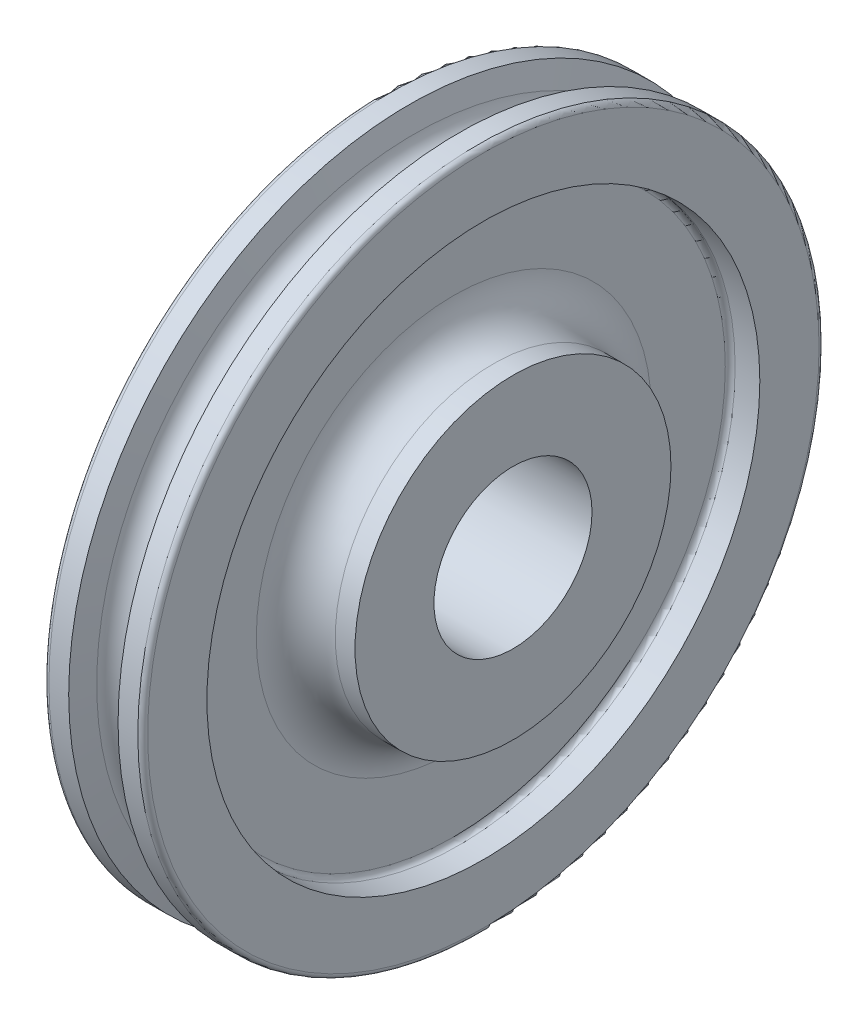
ISO-10303-21;
HEADER;
FILE_DESCRIPTION(('STEP AP214'),'2;1');
FILE_NAME('part.step','',(''),(''),'','','');
FILE_SCHEMA(('AUTOMOTIVE_DESIGN { 1 0 10303 214 1 1 1 1 }'));
ENDSEC;
DATA;
#1=APPLICATION_CONTEXT('core data for automotive mechanical design processes');
#2=APPLICATION_PROTOCOL_DEFINITION('international standard','automotive_design',2000,#1);
#3=PRODUCT_CONTEXT('',#1,'mechanical');
#4=PRODUCT('Part','Part','',(#3));
#5=PRODUCT_RELATED_PRODUCT_CATEGORY('part','',(#4));
#6=PRODUCT_DEFINITION_FORMATION('','',#4);
#7=PRODUCT_DEFINITION_CONTEXT('part definition',#1,'design');
#8=PRODUCT_DEFINITION('design','',#6,#7);
#9=PRODUCT_DEFINITION_SHAPE('','',#8);
#10=(LENGTH_UNIT() NAMED_UNIT(*) SI_UNIT(.MILLI.,.METRE.));
#11=(NAMED_UNIT(*) PLANE_ANGLE_UNIT() SI_UNIT($,.RADIAN.));
#12=(NAMED_UNIT(*) SI_UNIT($,.STERADIAN.) SOLID_ANGLE_UNIT());
#13=UNCERTAINTY_MEASURE_WITH_UNIT(LENGTH_MEASURE(1.E-05),#10,'distance_accuracy_value','');
#14=(GEOMETRIC_REPRESENTATION_CONTEXT(3) GLOBAL_UNCERTAINTY_ASSIGNED_CONTEXT((#13)) GLOBAL_UNIT_ASSIGNED_CONTEXT((#10,
#11,#12)) REPRESENTATION_CONTEXT('',''));
#15=CARTESIAN_POINT('',(0.,0.,0.));
#16=DIRECTION('',(0.,0.,1.));
#17=DIRECTION('',(1.,0.,0.));
#18=AXIS2_PLACEMENT_3D('',#15,#16,#17);
#19=CARTESIAN_POINT('',(15.875,-40.6942899842473,0.));
#20=DIRECTION('',(1.,0.,0.));
#21=DIRECTION('',(0.,0.,-1.));
#22=AXIS2_PLACEMENT_3D('',#19,#20,#21);
#23=PLANE('',#22);
#24=CARTESIAN_POINT('',(15.875,0.,0.));
#25=DIRECTION('',(1.,0.,0.));
#26=DIRECTION('',(0.,0.,-1.));
#27=AXIS2_PLACEMENT_3D('',#24,#25,#26);
#28=CIRCLE('',#27,107.95);
#29=CARTESIAN_POINT('',(15.875,0.,-107.95));
#30=VERTEX_POINT('',#29);
#31=EDGE_CURVE('E10',#30,#30,#28,.T.);
#32=ORIENTED_EDGE('',*,*,#31,.T.);
#33=EDGE_LOOP('',(#32));
#34=FACE_BOUND('',#33,.T.);
#35=CARTESIAN_POINT('',(15.875,0.,0.));
#36=DIRECTION('',(1.,0.,0.));
#37=DIRECTION('',(0.,0.,-1.));
#38=AXIS2_PLACEMENT_3D('',#35,#36,#37);
#39=CIRCLE('',#38,88.9);
#40=CARTESIAN_POINT('',(15.875,0.,-88.9));
#41=VERTEX_POINT('',#40);
#42=EDGE_CURVE('E469',#41,#41,#39,.T.);
#43=ORIENTED_EDGE('',*,*,#42,.F.);
#44=EDGE_LOOP('',(#43));
#45=FACE_BOUND('',#44,.T.);
#46=ADVANCED_FACE('F405',(#34,#45),#23,.T.);
#47=CARTESIAN_POINT('',(14.2875,0.,0.));
#48=DIRECTION('',(1.,0.,0.));
#49=DIRECTION('',(0.,0.,-1.));
#50=AXIS2_PLACEMENT_3D('',#47,#48,#49);
#51=TOROIDAL_SURFACE('',#50,107.95,1.5875);
#52=CARTESIAN_POINT('',(14.2875,0.,0.));
#53=DIRECTION('',(1.,0.,0.));
#54=DIRECTION('',(0.,0.,-1.));
#55=AXIS2_PLACEMENT_3D('',#52,#53,#54);
#56=CIRCLE('',#55,109.5375);
#57=CARTESIAN_POINT('',(14.2875,0.,-109.5375));
#58=VERTEX_POINT('',#57);
#59=EDGE_CURVE('E411',#58,#58,#56,.T.);
#60=ORIENTED_EDGE('',*,*,#59,.T.);
#61=EDGE_LOOP('',(#60));
#62=FACE_BOUND('',#61,.T.);
#63=ORIENTED_EDGE('',*,*,#31,.F.);
#64=EDGE_LOOP('',(#63));
#65=FACE_BOUND('',#64,.T.);
#66=ADVANCED_FACE('F523',(#62,#65),#51,.T.);
#67=CARTESIAN_POINT('',(25.4,0.,0.));
#68=DIRECTION('',(1.,0.,0.));
#69=DIRECTION('',(0.,0.,-1.));
#70=AXIS2_PLACEMENT_3D('',#67,#68,#69);
#71=CYLINDRICAL_SURFACE('',#70,109.5375);
#72=ORIENTED_EDGE('',*,*,#59,.F.);
#73=EDGE_LOOP('',(#72));
#74=FACE_BOUND('',#73,.T.);
#75=CARTESIAN_POINT('',(7.93750000000003,0.,0.));
#76=DIRECTION('',(1.,0.,0.));
#77=DIRECTION('',(0.,0.,-1.));
#78=AXIS2_PLACEMENT_3D('',#75,#76,#77);
#79=CIRCLE('',#78,109.5375);
#80=CARTESIAN_POINT('',(7.93750000000003,0.,-109.5375));
#81=VERTEX_POINT('',#80);
#82=EDGE_CURVE('E415',#81,#81,#79,.T.);
#83=ORIENTED_EDGE('',*,*,#82,.T.);
#84=EDGE_LOOP('',(#83));
#85=FACE_BOUND('',#84,.T.);
#86=ADVANCED_FACE('F527',(#74,#85),#71,.T.);
#87=CARTESIAN_POINT('',(6.27184540702009,0.,0.));
#88=DIRECTION('',(1.,0.,0.));
#89=DIRECTION('',(0.,0.,-1.));
#90=AXIS2_PLACEMENT_3D('',#87,#88,#89);
#91=CONICAL_SURFACE('',#90,102.19429549415,1.34774132912223);
#92=ORIENTED_EDGE('',*,*,#82,.F.);
#93=EDGE_LOOP('',(#92));
#94=FACE_BOUND('',#93,.T.);
#95=CARTESIAN_POINT('',(6.27184540702009,0.,0.));
#96=DIRECTION('',(1.,0.,0.));
#97=DIRECTION('',(0.,0.,-1.));
#98=AXIS2_PLACEMENT_3D('',#95,#96,#97);
#99=CIRCLE('',#98,102.19429549415);
#100=CARTESIAN_POINT('',(6.27184540702009,0.,-102.19429549415));
#101=VERTEX_POINT('',#100);
#102=EDGE_CURVE('E419',#101,#101,#99,.T.);
#103=ORIENTED_EDGE('',*,*,#102,.T.);
#104=EDGE_LOOP('',(#103));
#105=FACE_BOUND('',#104,.T.);
#106=ADVANCED_FACE('F533',(#94,#105),#91,.T.);
#107=CARTESIAN_POINT('',(0.,0.,0.));
#108=DIRECTION('',(1.,0.,0.));
#109=DIRECTION('',(0.,0.,-1.));
#110=AXIS2_PLACEMENT_3D('',#107,#108,#109);
#111=TOROIDAL_SURFACE('',#110,103.1875,6.34999999999996);
#112=ORIENTED_EDGE('',*,*,#102,.F.);
#113=EDGE_LOOP('',(#112));
#114=FACE_BOUND('',#113,.T.);
#115=CARTESIAN_POINT('',(-6.27184540702005,0.,0.));
#116=DIRECTION('',(1.,0.,0.));
#117=DIRECTION('',(0.,0.,-1.));
#118=AXIS2_PLACEMENT_3D('',#115,#116,#117);
#119=CIRCLE('',#118,102.19429549415);
#120=CARTESIAN_POINT('',(-6.27184540702005,0.,-102.19429549415));
#121=VERTEX_POINT('',#120);
#122=EDGE_CURVE('E424',#121,#121,#119,.T.);
#123=ORIENTED_EDGE('',*,*,#122,.T.);
#124=EDGE_LOOP('',(#123));
#125=FACE_BOUND('',#124,.T.);
#126=ADVANCED_FACE('F540',(#114,#125),#111,.F.);
#127=CARTESIAN_POINT('',(-6.27184540702005,0.,0.));
#128=DIRECTION('',(-1.,0.,0.));
#129=DIRECTION('',(0.,0.,1.));
#130=AXIS2_PLACEMENT_3D('',#127,#128,#129);
#131=CONICAL_SURFACE('',#130,102.19429549415,1.34774132912223);
#132=CARTESIAN_POINT('',(-7.93749999999998,0.,0.));
#133=DIRECTION('',(1.,0.,0.));
#134=DIRECTION('',(0.,0.,-1.));
#135=AXIS2_PLACEMENT_3D('',#132,#133,#134);
#136=CIRCLE('',#135,109.5375);
#137=CARTESIAN_POINT('',(-7.93749999999998,0.,-109.5375));
#138=VERTEX_POINT('',#137);
#139=EDGE_CURVE('E427',#138,#138,#136,.T.);
#140=ORIENTED_EDGE('',*,*,#139,.T.);
#141=EDGE_LOOP('',(#140));
#142=FACE_BOUND('',#141,.T.);
#143=ORIENTED_EDGE('',*,*,#122,.F.);
#144=EDGE_LOOP('',(#143));
#145=FACE_BOUND('',#144,.T.);
#146=ADVANCED_FACE('F544',(#142,#145),#131,.T.);
#147=CARTESIAN_POINT('',(25.4,0.,0.));
#148=DIRECTION('',(1.,0.,0.));
#149=DIRECTION('',(0.,0.,-1.));
#150=AXIS2_PLACEMENT_3D('',#147,#148,#149);
#151=CYLINDRICAL_SURFACE('',#150,109.5375);
#152=ORIENTED_EDGE('',*,*,#139,.F.);
#153=EDGE_LOOP('',(#152));
#154=FACE_BOUND('',#153,.T.);
#155=CARTESIAN_POINT('',(-14.2875,0.,0.));
#156=DIRECTION('',(1.,0.,0.));
#157=DIRECTION('',(0.,0.,-1.));
#158=AXIS2_PLACEMENT_3D('',#155,#156,#157);
#159=CIRCLE('',#158,109.5375);
#160=CARTESIAN_POINT('',(-14.2875,0.,-109.5375));
#161=VERTEX_POINT('',#160);
#162=EDGE_CURVE('E430',#161,#161,#159,.T.);
#163=ORIENTED_EDGE('',*,*,#162,.T.);
#164=EDGE_LOOP('',(#163));
#165=FACE_BOUND('',#164,.T.);
#166=ADVANCED_FACE('F548',(#154,#165),#151,.T.);
#167=CARTESIAN_POINT('',(-14.2875,0.,0.));
#168=DIRECTION('',(1.,0.,0.));
#169=DIRECTION('',(0.,0.,-1.));
#170=AXIS2_PLACEMENT_3D('',#167,#168,#169);
#171=TOROIDAL_SURFACE('',#170,107.95,1.5875);
#172=CARTESIAN_POINT('',(-15.875,0.,0.));
#173=DIRECTION('',(1.,0.,0.));
#174=DIRECTION('',(0.,0.,-1.));
#175=AXIS2_PLACEMENT_3D('',#172,#173,#174);
#176=CIRCLE('',#175,107.95);
#177=CARTESIAN_POINT('',(-15.875,0.,-107.95));
#178=VERTEX_POINT('',#177);
#179=EDGE_CURVE('E433',#178,#178,#176,.T.);
#180=ORIENTED_EDGE('',*,*,#179,.T.);
#181=EDGE_LOOP('',(#180));
#182=FACE_BOUND('',#181,.T.);
#183=ORIENTED_EDGE('',*,*,#162,.F.);
#184=EDGE_LOOP('',(#183));
#185=FACE_BOUND('',#184,.T.);
#186=ADVANCED_FACE('F552',(#182,#185),#171,.T.);
#187=CARTESIAN_POINT('',(-15.875,-40.6942899842473,0.));
#188=DIRECTION('',(1.,0.,0.));
#189=DIRECTION('',(0.,0.,-1.));
#190=AXIS2_PLACEMENT_3D('',#187,#188,#189);
#191=PLANE('',#190);
#192=ORIENTED_EDGE('',*,*,#179,.F.);
#193=EDGE_LOOP('',(#192));
#194=FACE_BOUND('',#193,.T.);
#195=CARTESIAN_POINT('',(-15.875,0.,0.));
#196=DIRECTION('',(1.,0.,0.));
#197=DIRECTION('',(0.,0.,-1.));
#198=AXIS2_PLACEMENT_3D('',#195,#196,#197);
#199=CIRCLE('',#198,88.9);
#200=CARTESIAN_POINT('',(-15.875,0.,-88.9));
#201=VERTEX_POINT('',#200);
#202=EDGE_CURVE('E436',#201,#201,#199,.T.);
#203=ORIENTED_EDGE('',*,*,#202,.T.);
#204=EDGE_LOOP('',(#203));
#205=FACE_BOUND('',#204,.T.);
#206=ADVANCED_FACE('F556',(#194,#205),#191,.F.);
#207=CARTESIAN_POINT('',(25.4,0.,0.));
#208=DIRECTION('',(1.,0.,0.));
#209=DIRECTION('',(0.,0.,-1.));
#210=AXIS2_PLACEMENT_3D('',#207,#208,#209);
#211=CYLINDRICAL_SURFACE('',#210,88.9);
#212=CARTESIAN_POINT('',(-7.93749999999998,0.,0.));
#213=DIRECTION('',(1.,0.,0.));
#214=DIRECTION('',(0.,0.,-1.));
#215=AXIS2_PLACEMENT_3D('',#212,#213,#214);
#216=CIRCLE('',#215,88.9);
#217=CARTESIAN_POINT('',(-7.93749999999998,0.,-88.9));
#218=VERTEX_POINT('',#217);
#219=EDGE_CURVE('E439',#218,#218,#216,.T.);
#220=ORIENTED_EDGE('',*,*,#219,.T.);
#221=EDGE_LOOP('',(#220));
#222=FACE_BOUND('',#221,.T.);
#223=ORIENTED_EDGE('',*,*,#202,.F.);
#224=EDGE_LOOP('',(#223));
#225=FACE_BOUND('',#224,.T.);
#226=ADVANCED_FACE('F560',(#222,#225),#211,.F.);
#227=CARTESIAN_POINT('',(-7.93749999999998,0.,0.));
#228=DIRECTION('',(1.,0.,0.));
#229=DIRECTION('',(0.,0.,-1.));
#230=AXIS2_PLACEMENT_3D('',#227,#228,#229);
#231=TOROIDAL_SURFACE('',#230,87.3125,1.5875);
#232=ORIENTED_EDGE('',*,*,#219,.F.);
#233=EDGE_LOOP('',(#232));
#234=FACE_BOUND('',#233,.T.);
#235=CARTESIAN_POINT('',(-6.34999999999998,0.,0.));
#236=DIRECTION('',(1.,0.,0.));
#237=DIRECTION('',(0.,0.,-1.));
#238=AXIS2_PLACEMENT_3D('',#235,#236,#237);
#239=CIRCLE('',#238,87.3125);
#240=CARTESIAN_POINT('',(-6.34999999999998,0.,-87.3125));
#241=VERTEX_POINT('',#240);
#242=EDGE_CURVE('E442',#241,#241,#239,.T.);
#243=ORIENTED_EDGE('',*,*,#242,.T.);
#244=EDGE_LOOP('',(#243));
#245=FACE_BOUND('',#244,.T.);
#246=ADVANCED_FACE('F564',(#234,#245),#231,.F.);
#247=CARTESIAN_POINT('',(-6.34999999999998,-40.6942899842473,0.));
#248=DIRECTION('',(-1.,0.,0.));
#249=DIRECTION('',(0.,0.,1.));
#250=AXIS2_PLACEMENT_3D('',#247,#248,#249);
#251=PLANE('',#250);
#252=CARTESIAN_POINT('',(-6.34999999999998,0.,0.));
#253=DIRECTION('',(1.,0.,0.));
#254=DIRECTION('',(0.,0.,-1.));
#255=AXIS2_PLACEMENT_3D('',#252,#253,#254);
#256=CIRCLE('',#255,63.5);
#257=CARTESIAN_POINT('',(-6.34999999999998,0.,-63.5));
#258=VERTEX_POINT('',#257);
#259=EDGE_CURVE('E445',#258,#258,#256,.T.);
#260=ORIENTED_EDGE('',*,*,#259,.T.);
#261=EDGE_LOOP('',(#260));
#262=FACE_BOUND('',#261,.T.);
#263=ORIENTED_EDGE('',*,*,#242,.F.);
#264=EDGE_LOOP('',(#263));
#265=FACE_BOUND('',#264,.T.);
#266=ADVANCED_FACE('F568',(#262,#265),#251,.T.);
#267=CARTESIAN_POINT('',(-19.05,0.,0.));
#268=DIRECTION('',(1.,0.,0.));
#269=DIRECTION('',(0.,0.,-1.));
#270=AXIS2_PLACEMENT_3D('',#267,#268,#269);
#271=TOROIDAL_SURFACE('',#270,63.5,12.7);
#272=ORIENTED_EDGE('',*,*,#259,.F.);
#273=EDGE_LOOP('',(#272));
#274=FACE_BOUND('',#273,.T.);
#275=CARTESIAN_POINT('',(-19.05,0.,0.));
#276=DIRECTION('',(1.,0.,0.));
#277=DIRECTION('',(0.,0.,-1.));
#278=AXIS2_PLACEMENT_3D('',#275,#276,#277);
#279=CIRCLE('',#278,50.8);
#280=CARTESIAN_POINT('',(-19.05,0.,-50.8));
#281=VERTEX_POINT('',#280);
#282=EDGE_CURVE('E448',#281,#281,#279,.T.);
#283=ORIENTED_EDGE('',*,*,#282,.T.);
#284=EDGE_LOOP('',(#283));
#285=FACE_BOUND('',#284,.T.);
#286=ADVANCED_FACE('F572',(#274,#285),#271,.F.);
#287=CARTESIAN_POINT('',(25.4,0.,0.));
#288=DIRECTION('',(1.,0.,0.));
#289=DIRECTION('',(0.,0.,-1.));
#290=AXIS2_PLACEMENT_3D('',#287,#288,#289);
#291=CYLINDRICAL_SURFACE('',#290,50.8);
#292=ORIENTED_EDGE('',*,*,#282,.F.);
#293=EDGE_LOOP('',(#292));
#294=FACE_BOUND('',#293,.T.);
#295=CARTESIAN_POINT('',(-25.4,0.,0.));
#296=DIRECTION('',(1.,0.,0.));
#297=DIRECTION('',(0.,0.,-1.));
#298=AXIS2_PLACEMENT_3D('',#295,#296,#297);
#299=CIRCLE('',#298,50.8);
#300=CARTESIAN_POINT('',(-25.4,0.,-50.8));
#301=VERTEX_POINT('',#300);
#302=EDGE_CURVE('E451',#301,#301,#299,.T.);
#303=ORIENTED_EDGE('',*,*,#302,.T.);
#304=EDGE_LOOP('',(#303));
#305=FACE_BOUND('',#304,.T.);
#306=ADVANCED_FACE('F576',(#294,#305),#291,.T.);
#307=CARTESIAN_POINT('',(-25.4,-40.6942899842473,0.));
#308=DIRECTION('',(1.,0.,0.));
#309=DIRECTION('',(0.,0.,-1.));
#310=AXIS2_PLACEMENT_3D('',#307,#308,#309);
#311=PLANE('',#310);
#312=CARTESIAN_POINT('',(-25.4,0.,0.));
#313=DIRECTION('',(1.,0.,0.));
#314=DIRECTION('',(0.,0.,-1.));
#315=AXIS2_PLACEMENT_3D('',#312,#313,#314);
#316=CIRCLE('',#315,25.4127);
#317=CARTESIAN_POINT('',(-25.4,0.,-25.4127));
#318=VERTEX_POINT('',#317);
#319=EDGE_CURVE('E472',#318,#318,#316,.T.);
#320=ORIENTED_EDGE('',*,*,#319,.T.);
#321=EDGE_LOOP('',(#320));
#322=FACE_BOUND('',#321,.T.);
#323=ORIENTED_EDGE('',*,*,#302,.F.);
#324=EDGE_LOOP('',(#323));
#325=FACE_BOUND('',#324,.T.);
#326=ADVANCED_FACE('F485',(#322,#325),#311,.F.);
#327=CARTESIAN_POINT('',(25.4,-40.6942899842473,0.));
#328=DIRECTION('',(1.,0.,0.));
#329=DIRECTION('',(0.,0.,-1.));
#330=AXIS2_PLACEMENT_3D('',#327,#328,#329);
#331=PLANE('',#330);
#332=CARTESIAN_POINT('',(25.4,0.,0.));
#333=DIRECTION('',(1.,0.,0.));
#334=DIRECTION('',(0.,0.,-1.));
#335=AXIS2_PLACEMENT_3D('',#332,#333,#334);
#336=CIRCLE('',#335,25.4127);
#337=CARTESIAN_POINT('',(25.4,0.,-25.4127));
#338=VERTEX_POINT('',#337);
#339=EDGE_CURVE('E475',#338,#338,#336,.T.);
#340=ORIENTED_EDGE('',*,*,#339,.F.);
#341=EDGE_LOOP('',(#340));
#342=FACE_BOUND('',#341,.T.);
#343=CARTESIAN_POINT('',(25.4,0.,0.));
#344=DIRECTION('',(1.,0.,0.));
#345=DIRECTION('',(0.,0.,-1.));
#346=AXIS2_PLACEMENT_3D('',#343,#344,#345);
#347=CIRCLE('',#346,50.8);
#348=CARTESIAN_POINT('',(25.4,0.,-50.8));
#349=VERTEX_POINT('',#348);
#350=EDGE_CURVE('E454',#349,#349,#347,.T.);
#351=ORIENTED_EDGE('',*,*,#350,.T.);
#352=EDGE_LOOP('',(#351));
#353=FACE_BOUND('',#352,.T.);
#354=ADVANCED_FACE('F481',(#342,#353),#331,.T.);
#355=CARTESIAN_POINT('',(25.4,0.,0.));
#356=DIRECTION('',(1.,0.,0.));
#357=DIRECTION('',(0.,0.,-1.));
#358=AXIS2_PLACEMENT_3D('',#355,#356,#357);
#359=CYLINDRICAL_SURFACE('',#358,50.8);
#360=ORIENTED_EDGE('',*,*,#350,.F.);
#361=EDGE_LOOP('',(#360));
#362=FACE_BOUND('',#361,.T.);
#363=CARTESIAN_POINT('',(19.05,0.,0.));
#364=DIRECTION('',(1.,0.,0.));
#365=DIRECTION('',(0.,0.,-1.));
#366=AXIS2_PLACEMENT_3D('',#363,#364,#365);
#367=CIRCLE('',#366,50.8);
#368=CARTESIAN_POINT('',(19.05,0.,-50.8));
#369=VERTEX_POINT('',#368);
#370=EDGE_CURVE('E457',#369,#369,#367,.T.);
#371=ORIENTED_EDGE('',*,*,#370,.T.);
#372=EDGE_LOOP('',(#371));
#373=FACE_BOUND('',#372,.T.);
#374=ADVANCED_FACE('F484',(#362,#373),#359,.T.);
#375=CARTESIAN_POINT('',(19.05,0.,0.));
#376=DIRECTION('',(1.,0.,0.));
#377=DIRECTION('',(0.,0.,-1.));
#378=AXIS2_PLACEMENT_3D('',#375,#376,#377);
#379=TOROIDAL_SURFACE('',#378,63.5,12.7);
#380=ORIENTED_EDGE('',*,*,#370,.F.);
#381=EDGE_LOOP('',(#380));
#382=FACE_BOUND('',#381,.T.);
#383=CARTESIAN_POINT('',(6.35000000000003,0.,0.));
#384=DIRECTION('',(1.,0.,0.));
#385=DIRECTION('',(0.,0.,-1.));
#386=AXIS2_PLACEMENT_3D('',#383,#384,#385);
#387=CIRCLE('',#386,63.5000000000004);
#388=CARTESIAN_POINT('',(6.35000000000003,0.,-63.5000000000004));
#389=VERTEX_POINT('',#388);
#390=EDGE_CURVE('E460',#389,#389,#387,.T.);
#391=ORIENTED_EDGE('',*,*,#390,.T.);
#392=EDGE_LOOP('',(#391));
#393=FACE_BOUND('',#392,.T.);
#394=ADVANCED_FACE('F491',(#382,#393),#379,.F.);
#395=CARTESIAN_POINT('',(6.35000000000011,-40.6942899842474,0.));
#396=DIRECTION('',(-1.,0.,0.));
#397=DIRECTION('',(0.,0.,1.));
#398=AXIS2_PLACEMENT_3D('',#395,#396,#397);
#399=PLANE('',#398);
#400=ORIENTED_EDGE('',*,*,#390,.F.);
#401=EDGE_LOOP('',(#400));
#402=FACE_BOUND('',#401,.T.);
#403=CARTESIAN_POINT('',(6.35000000000021,0.,0.));
#404=DIRECTION('',(1.,0.,0.));
#405=DIRECTION('',(0.,0.,-1.));
#406=AXIS2_PLACEMENT_3D('',#403,#404,#405);
#407=CIRCLE('',#406,87.3125);
#408=CARTESIAN_POINT('',(6.35000000000021,0.,-87.3125));
#409=VERTEX_POINT('',#408);
#410=EDGE_CURVE('E463',#409,#409,#407,.T.);
#411=ORIENTED_EDGE('',*,*,#410,.T.);
#412=EDGE_LOOP('',(#411));
#413=FACE_BOUND('',#412,.T.);
#414=ADVANCED_FACE('F497',(#402,#413),#399,.F.);
#415=CARTESIAN_POINT('',(7.93750000000021,0.,0.));
#416=DIRECTION('',(1.,0.,0.));
#417=DIRECTION('',(0.,0.,-1.));
#418=AXIS2_PLACEMENT_3D('',#415,#416,#417);
#419=TOROIDAL_SURFACE('',#418,87.3125,1.5875);
#420=ORIENTED_EDGE('',*,*,#410,.F.);
#421=EDGE_LOOP('',(#420));
#422=FACE_BOUND('',#421,.T.);
#423=CARTESIAN_POINT('',(7.93750000000021,0.,0.));
#424=DIRECTION('',(1.,0.,0.));
#425=DIRECTION('',(0.,0.,-1.));
#426=AXIS2_PLACEMENT_3D('',#423,#424,#425);
#427=CIRCLE('',#426,88.9);
#428=CARTESIAN_POINT('',(7.93750000000021,0.,-88.9));
#429=VERTEX_POINT('',#428);
#430=EDGE_CURVE('E466',#429,#429,#427,.T.);
#431=ORIENTED_EDGE('',*,*,#430,.T.);
#432=EDGE_LOOP('',(#431));
#433=FACE_BOUND('',#432,.T.);
#434=ADVANCED_FACE('F503',(#422,#433),#419,.F.);
#435=CARTESIAN_POINT('',(25.4,0.,0.));
#436=DIRECTION('',(1.,0.,0.));
#437=DIRECTION('',(0.,0.,-1.));
#438=AXIS2_PLACEMENT_3D('',#435,#436,#437);
#439=CYLINDRICAL_SURFACE('',#438,88.9);
#440=ORIENTED_EDGE('',*,*,#42,.T.);
#441=EDGE_LOOP('',(#440));
#442=FACE_BOUND('',#441,.T.);
#443=ORIENTED_EDGE('',*,*,#430,.F.);
#444=EDGE_LOOP('',(#443));
#445=FACE_BOUND('',#444,.T.);
#446=ADVANCED_FACE('F509',(#442,#445),#439,.F.);
#447=CARTESIAN_POINT('',(-25.4,0.,0.));
#448=DIRECTION('',(1.,0.,0.));
#449=DIRECTION('',(0.,0.,-1.));
#450=AXIS2_PLACEMENT_3D('',#447,#448,#449);
#451=CYLINDRICAL_SURFACE('',#450,25.4127);
#452=ORIENTED_EDGE('',*,*,#319,.F.);
#453=EDGE_LOOP('',(#452));
#454=FACE_BOUND('',#453,.T.);
#455=ORIENTED_EDGE('',*,*,#339,.T.);
#456=EDGE_LOOP('',(#455));
#457=FACE_BOUND('',#456,.T.);
#458=ADVANCED_FACE('F479',(#454,#457),#451,.F.);
#459=CLOSED_SHELL('',(#46,#66,#86,#106,#126,#146,#166,#186,#206,#226,#246,#266,#286,#306,#326,
#354,#374,#394,#414,#434,#446,#458));
#460=MANIFOLD_SOLID_BREP('B2',#459);
#461=ADVANCED_BREP_SHAPE_REPRESENTATION('',(#18,#460),#14);
#462=SHAPE_DEFINITION_REPRESENTATION(#9,#461);
ENDSEC;
END-ISO-10303-21;
